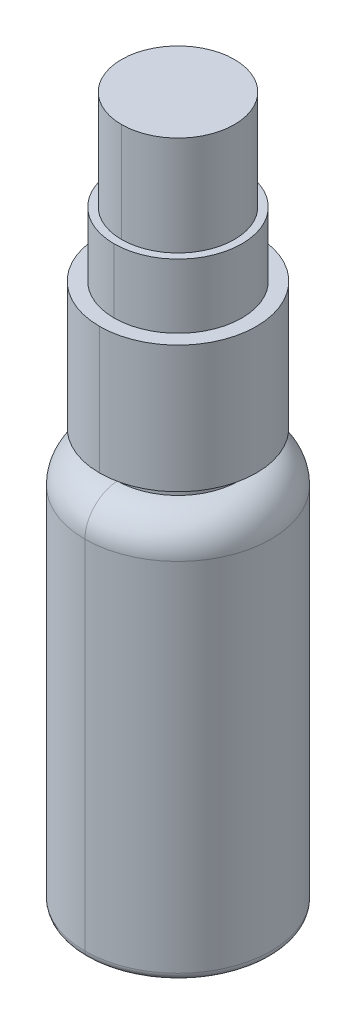
ISO-10303-21;
HEADER;
FILE_DESCRIPTION(('STEP AP214'),'2;1');
FILE_NAME('part.step','',(''),(''),'','','');
FILE_SCHEMA(('AUTOMOTIVE_DESIGN { 1 0 10303 214 1 1 1 1 }'));
ENDSEC;
DATA;
#1=APPLICATION_CONTEXT('core data for automotive mechanical design processes');
#2=APPLICATION_PROTOCOL_DEFINITION('international standard','automotive_design',2000,#1);
#3=PRODUCT_CONTEXT('',#1,'mechanical');
#4=PRODUCT('Part','Part','',(#3));
#5=PRODUCT_RELATED_PRODUCT_CATEGORY('part','',(#4));
#6=PRODUCT_DEFINITION_FORMATION('','',#4);
#7=PRODUCT_DEFINITION_CONTEXT('part definition',#1,'design');
#8=PRODUCT_DEFINITION('design','',#6,#7);
#9=PRODUCT_DEFINITION_SHAPE('','',#8);
#10=(LENGTH_UNIT() NAMED_UNIT(*) SI_UNIT(.MILLI.,.METRE.));
#11=(NAMED_UNIT(*) PLANE_ANGLE_UNIT() SI_UNIT($,.RADIAN.));
#12=(NAMED_UNIT(*) SI_UNIT($,.STERADIAN.) SOLID_ANGLE_UNIT());
#13=UNCERTAINTY_MEASURE_WITH_UNIT(LENGTH_MEASURE(1.E-05),#10,'distance_accuracy_value','');
#14=(GEOMETRIC_REPRESENTATION_CONTEXT(3) GLOBAL_UNCERTAINTY_ASSIGNED_CONTEXT((#13)) GLOBAL_UNIT_ASSIGNED_CONTEXT((#10,
#11,#12)) REPRESENTATION_CONTEXT('',''));
#15=CARTESIAN_POINT('',(0.,0.,0.));
#16=DIRECTION('',(0.,0.,1.));
#17=DIRECTION('',(1.,0.,0.));
#18=AXIS2_PLACEMENT_3D('',#15,#16,#17);
#19=CARTESIAN_POINT('',(0.,46.5,0.));
#20=DIRECTION('',(0.,1.,0.));
#21=DIRECTION('',(0.,0.,1.));
#22=AXIS2_PLACEMENT_3D('',#19,#20,#21);
#23=TOROIDAL_SURFACE('',#22,7.5,4.375);
#24=CARTESIAN_POINT('',(0.,46.5,-7.5));
#25=DIRECTION('',(1.,0.,0.));
#26=DIRECTION('',(0.,0.,-1.));
#27=AXIS2_PLACEMENT_3D('',#24,#25,#26);
#28=CIRCLE('',#27,4.375);
#29=CARTESIAN_POINT('',(0.,46.5,-11.875));
#30=VERTEX_POINT('',#29);
#31=CARTESIAN_POINT('',(0.,50.875,-7.5));
#32=VERTEX_POINT('',#31);
#33=EDGE_CURVE('E358',#30,#32,#28,.T.);
#34=ORIENTED_EDGE('',*,*,#33,.F.);
#35=CARTESIAN_POINT('',(0.,46.5,0.));
#36=DIRECTION('',(0.,1.,0.));
#37=DIRECTION('',(0.,0.,1.));
#38=AXIS2_PLACEMENT_3D('',#35,#36,#37);
#39=CIRCLE('',#38,11.875);
#40=CARTESIAN_POINT('',(0.,46.5,11.875));
#41=VERTEX_POINT('',#40);
#42=EDGE_CURVE('E11',#30,#41,#39,.T.);
#43=ORIENTED_EDGE('',*,*,#42,.T.);
#44=CARTESIAN_POINT('',(0.,46.5,7.5));
#45=DIRECTION('',(-1.,0.,0.));
#46=DIRECTION('',(0.,0.,1.));
#47=AXIS2_PLACEMENT_3D('',#44,#45,#46);
#48=CIRCLE('',#47,4.375);
#49=CARTESIAN_POINT('',(0.,50.875,7.5));
#50=VERTEX_POINT('',#49);
#51=EDGE_CURVE('E201',#41,#50,#48,.T.);
#52=ORIENTED_EDGE('',*,*,#51,.T.);
#53=CARTESIAN_POINT('',(0.,50.875,0.));
#54=DIRECTION('',(0.,1.,0.));
#55=DIRECTION('',(0.,0.,1.));
#56=AXIS2_PLACEMENT_3D('',#53,#54,#55);
#57=CIRCLE('',#56,7.5);
#58=EDGE_CURVE('E246',#32,#50,#57,.T.);
#59=ORIENTED_EDGE('',*,*,#58,.F.);
#60=EDGE_LOOP('',(#34,#43,#52,#59));
#61=FACE_BOUND('',#60,.T.);
#62=ADVANCED_FACE('F17',(#61),#23,.T.);
#63=CARTESIAN_POINT('',(0.,65.8,0.));
#64=DIRECTION('',(0.,1.,0.));
#65=DIRECTION('',(0.,0.,1.));
#66=AXIS2_PLACEMENT_3D('',#63,#64,#65);
#67=CYLINDRICAL_SURFACE('',#66,11.875);
#68=DIRECTION('',(0.,1.,0.));
#69=VECTOR('',#68,1.);
#70=CARTESIAN_POINT('',(0.,65.8,-11.875));
#71=LINE('',#70,#69);
#72=CARTESIAN_POINT('',(0.,1.,-11.875));
#73=VERTEX_POINT('',#72);
#74=EDGE_CURVE('E192',#73,#30,#71,.T.);
#75=ORIENTED_EDGE('',*,*,#74,.F.);
#76=CARTESIAN_POINT('',(0.,1.,0.));
#77=DIRECTION('',(0.,1.,0.));
#78=DIRECTION('',(0.,0.,1.));
#79=AXIS2_PLACEMENT_3D('',#76,#77,#78);
#80=CIRCLE('',#79,11.875);
#81=CARTESIAN_POINT('',(0.,1.,11.875));
#82=VERTEX_POINT('',#81);
#83=EDGE_CURVE('E26',#73,#82,#80,.T.);
#84=ORIENTED_EDGE('',*,*,#83,.T.);
#85=DIRECTION('',(0.,1.,0.));
#86=VECTOR('',#85,1.);
#87=CARTESIAN_POINT('',(0.,65.8,11.875));
#88=LINE('',#87,#86);
#89=EDGE_CURVE('E197',#82,#41,#88,.T.);
#90=ORIENTED_EDGE('',*,*,#89,.T.);
#91=ORIENTED_EDGE('',*,*,#42,.F.);
#92=EDGE_LOOP('',(#75,#84,#90,#91));
#93=FACE_BOUND('',#92,.T.);
#94=ADVANCED_FACE('F19',(#93),#67,.T.);
#95=CARTESIAN_POINT('',(0.,1.,0.));
#96=DIRECTION('',(0.,1.,0.));
#97=DIRECTION('',(0.,0.,1.));
#98=AXIS2_PLACEMENT_3D('',#95,#96,#97);
#99=TOROIDAL_SURFACE('',#98,10.875,1.);
#100=CARTESIAN_POINT('',(0.,1.,-10.875));
#101=DIRECTION('',(1.,0.,0.));
#102=DIRECTION('',(0.,0.,-1.));
#103=AXIS2_PLACEMENT_3D('',#100,#101,#102);
#104=CIRCLE('',#103,1.);
#105=CARTESIAN_POINT('',(0.,0.,-10.875));
#106=VERTEX_POINT('',#105);
#107=EDGE_CURVE('E171',#106,#73,#104,.T.);
#108=ORIENTED_EDGE('',*,*,#107,.F.);
#109=CARTESIAN_POINT('',(0.,0.,0.));
#110=DIRECTION('',(0.,1.,0.));
#111=DIRECTION('',(0.,0.,1.));
#112=AXIS2_PLACEMENT_3D('',#109,#110,#111);
#113=CIRCLE('',#112,10.875);
#114=CARTESIAN_POINT('',(0.,0.,10.875));
#115=VERTEX_POINT('',#114);
#116=EDGE_CURVE('E180',#106,#115,#113,.T.);
#117=ORIENTED_EDGE('',*,*,#116,.T.);
#118=CARTESIAN_POINT('',(0.,1.,10.875));
#119=DIRECTION('',(-1.,0.,0.));
#120=DIRECTION('',(0.,0.,1.));
#121=AXIS2_PLACEMENT_3D('',#118,#119,#120);
#122=CIRCLE('',#121,1.);
#123=EDGE_CURVE('E174',#115,#82,#122,.T.);
#124=ORIENTED_EDGE('',*,*,#123,.T.);
#125=ORIENTED_EDGE('',*,*,#83,.F.);
#126=EDGE_LOOP('',(#108,#117,#124,#125));
#127=FACE_BOUND('',#126,.T.);
#128=ADVANCED_FACE('F170',(#127),#99,.T.);
#129=CARTESIAN_POINT('',(9.75,0.,0.));
#130=DIRECTION('',(0.,1.,0.));
#131=DIRECTION('',(1.,0.,0.));
#132=AXIS2_PLACEMENT_3D('',#129,#130,#131);
#133=PLANE('',#132);
#134=CARTESIAN_POINT('',(0.,0.,0.));
#135=DIRECTION('',(0.,1.,0.));
#136=DIRECTION('',(0.,0.,1.));
#137=AXIS2_PLACEMENT_3D('',#134,#135,#136);
#138=CIRCLE('',#137,9.75);
#139=CARTESIAN_POINT('',(0.,0.,9.75));
#140=VERTEX_POINT('',#139);
#141=CARTESIAN_POINT('',(0.,0.,-9.75));
#142=VERTEX_POINT('',#141);
#143=EDGE_CURVE('E226',#140,#142,#138,.T.);
#144=ORIENTED_EDGE('',*,*,#143,.T.);
#145=CARTESIAN_POINT('',(0.,0.,0.));
#146=DIRECTION('',(0.,1.,0.));
#147=DIRECTION('',(0.,0.,1.));
#148=AXIS2_PLACEMENT_3D('',#145,#146,#147);
#149=CIRCLE('',#148,9.75);
#150=EDGE_CURVE('E346',#142,#140,#149,.T.);
#151=ORIENTED_EDGE('',*,*,#150,.T.);
#152=EDGE_LOOP('',(#144,#151));
#153=FACE_BOUND('',#152,.T.);
#154=CARTESIAN_POINT('',(0.,0.,0.));
#155=DIRECTION('',(0.,1.,0.));
#156=DIRECTION('',(0.,0.,1.));
#157=AXIS2_PLACEMENT_3D('',#154,#155,#156);
#158=CIRCLE('',#157,10.875);
#159=EDGE_CURVE('E188',#115,#106,#158,.T.);
#160=ORIENTED_EDGE('',*,*,#159,.F.);
#161=ORIENTED_EDGE('',*,*,#116,.F.);
#162=EDGE_LOOP('',(#160,#161));
#163=FACE_BOUND('',#162,.T.);
#164=ADVANCED_FACE('F393',(#153,#163),#133,.F.);
#165=CARTESIAN_POINT('',(0.,1.,0.));
#166=DIRECTION('',(0.,1.,0.));
#167=DIRECTION('',(0.,0.,1.));
#168=AXIS2_PLACEMENT_3D('',#165,#166,#167);
#169=TOROIDAL_SURFACE('',#168,9.75,1.);
#170=CARTESIAN_POINT('',(0.,1.,-9.75));
#171=DIRECTION('',(1.,0.,0.));
#172=DIRECTION('',(0.,0.,-1.));
#173=AXIS2_PLACEMENT_3D('',#170,#171,#172);
#174=CIRCLE('',#173,1.);
#175=CARTESIAN_POINT('',(0.,1.,-8.75));
#176=VERTEX_POINT('',#175);
#177=EDGE_CURVE('E230',#176,#142,#174,.T.);
#178=ORIENTED_EDGE('',*,*,#177,.F.);
#179=CARTESIAN_POINT('',(0.,1.,0.));
#180=DIRECTION('',(0.,1.,0.));
#181=DIRECTION('',(0.,0.,1.));
#182=AXIS2_PLACEMENT_3D('',#179,#180,#181);
#183=CIRCLE('',#182,8.75);
#184=CARTESIAN_POINT('',(0.,1.,8.75));
#185=VERTEX_POINT('',#184);
#186=EDGE_CURVE('E211',#176,#185,#183,.T.);
#187=ORIENTED_EDGE('',*,*,#186,.T.);
#188=CARTESIAN_POINT('',(0.,1.,9.75));
#189=DIRECTION('',(-1.,0.,0.));
#190=DIRECTION('',(0.,0.,1.));
#191=AXIS2_PLACEMENT_3D('',#188,#189,#190);
#192=CIRCLE('',#191,1.);
#193=EDGE_CURVE('E216',#185,#140,#192,.T.);
#194=ORIENTED_EDGE('',*,*,#193,.T.);
#195=ORIENTED_EDGE('',*,*,#150,.F.);
#196=EDGE_LOOP('',(#178,#187,#194,#195));
#197=FACE_BOUND('',#196,.T.);
#198=ADVANCED_FACE('F392',(#197),#169,.T.);
#199=CARTESIAN_POINT('',(0.,65.8,0.));
#200=DIRECTION('',(0.,1.,0.));
#201=DIRECTION('',(0.,0.,1.));
#202=AXIS2_PLACEMENT_3D('',#199,#200,#201);
#203=CYLINDRICAL_SURFACE('',#202,8.75);
#204=DIRECTION('',(0.,1.,0.));
#205=VECTOR('',#204,1.);
#206=CARTESIAN_POINT('',(0.,65.8,-8.75));
#207=LINE('',#206,#205);
#208=CARTESIAN_POINT('',(0.,1.40955855165527,-8.75));
#209=VERTEX_POINT('',#208);
#210=EDGE_CURVE('E215',#176,#209,#207,.T.);
#211=ORIENTED_EDGE('',*,*,#210,.F.);
#212=CARTESIAN_POINT('',(0.,1.,0.));
#213=DIRECTION('',(0.,1.,0.));
#214=DIRECTION('',(0.,0.,1.));
#215=AXIS2_PLACEMENT_3D('',#212,#213,#214);
#216=CIRCLE('',#215,8.75);
#217=EDGE_CURVE('E233',#185,#176,#216,.T.);
#218=ORIENTED_EDGE('',*,*,#217,.F.);
#219=DIRECTION('',(0.,1.,0.));
#220=VECTOR('',#219,1.);
#221=CARTESIAN_POINT('',(0.,65.8,8.75));
#222=LINE('',#221,#220);
#223=CARTESIAN_POINT('',(0.,1.40955855165527,8.75));
#224=VERTEX_POINT('',#223);
#225=EDGE_CURVE('E239',#185,#224,#222,.T.);
#226=ORIENTED_EDGE('',*,*,#225,.T.);
#227=CARTESIAN_POINT('',(0.,1.40955855165527,0.));
#228=DIRECTION('',(0.,1.,0.));
#229=DIRECTION('',(0.,0.,1.));
#230=AXIS2_PLACEMENT_3D('',#227,#228,#229);
#231=CIRCLE('',#230,8.75);
#232=EDGE_CURVE('E345',#224,#209,#231,.T.);
#233=ORIENTED_EDGE('',*,*,#232,.T.);
#234=EDGE_LOOP('',(#211,#218,#226,#233));
#235=FACE_BOUND('',#234,.T.);
#236=ADVANCED_FACE('F387',(#235),#203,.F.);
#237=CARTESIAN_POINT('',(0.,1.40955855165527,0.));
#238=DIRECTION('',(0.,1.,0.));
#239=DIRECTION('',(0.,0.,1.));
#240=AXIS2_PLACEMENT_3D('',#237,#238,#239);
#241=TOROIDAL_SURFACE('',#240,7.75,1.);
#242=CARTESIAN_POINT('',(0.,1.40955855165527,-7.75));
#243=DIRECTION('',(1.,0.,0.));
#244=DIRECTION('',(0.,0.,-1.));
#245=AXIS2_PLACEMENT_3D('',#242,#243,#244);
#246=CIRCLE('',#245,1.);
#247=CARTESIAN_POINT('',(0.,2.40955855165527,-7.75));
#248=VERTEX_POINT('',#247);
#249=EDGE_CURVE('E234',#209,#248,#246,.T.);
#250=ORIENTED_EDGE('',*,*,#249,.F.);
#251=ORIENTED_EDGE('',*,*,#232,.F.);
#252=CARTESIAN_POINT('',(0.,1.40955855165527,7.75));
#253=DIRECTION('',(-1.,0.,0.));
#254=DIRECTION('',(0.,0.,1.));
#255=AXIS2_PLACEMENT_3D('',#252,#253,#254);
#256=CIRCLE('',#255,1.);
#257=CARTESIAN_POINT('',(0.,2.40955855165527,7.75));
#258=VERTEX_POINT('',#257);
#259=EDGE_CURVE('E272',#224,#258,#256,.T.);
#260=ORIENTED_EDGE('',*,*,#259,.T.);
#261=CARTESIAN_POINT('',(0.,2.40955855165527,0.));
#262=DIRECTION('',(0.,1.,0.));
#263=DIRECTION('',(0.,0.,1.));
#264=AXIS2_PLACEMENT_3D('',#261,#262,#263);
#265=CIRCLE('',#264,7.75);
#266=EDGE_CURVE('E343',#258,#248,#265,.T.);
#267=ORIENTED_EDGE('',*,*,#266,.T.);
#268=EDGE_LOOP('',(#250,#251,#260,#267));
#269=FACE_BOUND('',#268,.T.);
#270=ADVANCED_FACE('F414',(#269),#241,.F.);
#271=CARTESIAN_POINT('',(7.75,2.40955855165527,0.));
#272=DIRECTION('',(0.,-1.,0.));
#273=DIRECTION('',(0.,0.,-1.));
#274=AXIS2_PLACEMENT_3D('',#271,#272,#273);
#275=PLANE('',#274);
#276=ORIENTED_EDGE('',*,*,#266,.F.);
#277=CARTESIAN_POINT('',(0.,2.40955855165527,0.));
#278=DIRECTION('',(0.,1.,0.));
#279=DIRECTION('',(0.,0.,1.));
#280=AXIS2_PLACEMENT_3D('',#277,#278,#279);
#281=CIRCLE('',#280,7.75);
#282=EDGE_CURVE('E238',#248,#258,#281,.T.);
#283=ORIENTED_EDGE('',*,*,#282,.F.);
#284=EDGE_LOOP('',(#276,#283));
#285=FACE_BOUND('',#284,.T.);
#286=ADVANCED_FACE('F415',(#285),#275,.T.);
#287=CARTESIAN_POINT('',(0.,89.975,0.));
#288=DIRECTION('',(0.,1.,0.));
#289=DIRECTION('',(1.,0.,0.));
#290=AXIS2_PLACEMENT_3D('',#287,#288,#289);
#291=PLANE('',#290);
#292=CARTESIAN_POINT('',(0.,89.975,0.));
#293=DIRECTION('',(0.,1.,0.));
#294=DIRECTION('',(0.,0.,1.));
#295=AXIS2_PLACEMENT_3D('',#292,#293,#294);
#296=CIRCLE('',#295,7.2);
#297=CARTESIAN_POINT('',(0.,89.975,7.2));
#298=VERTEX_POINT('',#297);
#299=CARTESIAN_POINT('',(0.,89.975,-7.2));
#300=VERTEX_POINT('',#299);
#301=EDGE_CURVE('E248',#298,#300,#296,.T.);
#302=ORIENTED_EDGE('',*,*,#301,.T.);
#303=CARTESIAN_POINT('',(0.,89.975,0.));
#304=DIRECTION('',(0.,1.,0.));
#305=DIRECTION('',(0.,0.,1.));
#306=AXIS2_PLACEMENT_3D('',#303,#304,#305);
#307=CIRCLE('',#306,7.2);
#308=EDGE_CURVE('E261',#300,#298,#307,.T.);
#309=ORIENTED_EDGE('',*,*,#308,.T.);
#310=EDGE_LOOP('',(#302,#309));
#311=FACE_BOUND('',#310,.T.);
#312=ADVANCED_FACE('F418',(#311),#291,.T.);
#313=CARTESIAN_POINT('',(0.,65.8,0.));
#314=DIRECTION('',(0.,1.,0.));
#315=DIRECTION('',(0.,0.,1.));
#316=AXIS2_PLACEMENT_3D('',#313,#314,#315);
#317=CYLINDRICAL_SURFACE('',#316,7.2);
#318=DIRECTION('',(0.,1.,0.));
#319=VECTOR('',#318,1.);
#320=CARTESIAN_POINT('',(0.,65.8,-7.2));
#321=LINE('',#320,#319);
#322=CARTESIAN_POINT('',(0.,77.275,-7.2));
#323=VERTEX_POINT('',#322);
#324=EDGE_CURVE('E253',#323,#300,#321,.T.);
#325=ORIENTED_EDGE('',*,*,#324,.F.);
#326=CARTESIAN_POINT('',(0.,77.275,0.));
#327=DIRECTION('',(0.,1.,0.));
#328=DIRECTION('',(0.,0.,1.));
#329=AXIS2_PLACEMENT_3D('',#326,#327,#328);
#330=CIRCLE('',#329,7.2);
#331=CARTESIAN_POINT('',(0.,77.275,7.2));
#332=VERTEX_POINT('',#331);
#333=EDGE_CURVE('E258',#323,#332,#330,.T.);
#334=ORIENTED_EDGE('',*,*,#333,.T.);
#335=DIRECTION('',(0.,1.,0.));
#336=VECTOR('',#335,1.);
#337=CARTESIAN_POINT('',(0.,65.8,7.2));
#338=LINE('',#337,#336);
#339=EDGE_CURVE('E252',#332,#298,#338,.T.);
#340=ORIENTED_EDGE('',*,*,#339,.T.);
#341=ORIENTED_EDGE('',*,*,#308,.F.);
#342=EDGE_LOOP('',(#325,#334,#340,#341));
#343=FACE_BOUND('',#342,.T.);
#344=ADVANCED_FACE('F422',(#343),#317,.T.);
#345=CARTESIAN_POINT('',(8.15,77.275,0.));
#346=DIRECTION('',(0.,-1.,0.));
#347=DIRECTION('',(0.,0.,-1.));
#348=AXIS2_PLACEMENT_3D('',#345,#346,#347);
#349=PLANE('',#348);
#350=CARTESIAN_POINT('',(0.,77.275,0.));
#351=DIRECTION('',(0.,1.,0.));
#352=DIRECTION('',(0.,0.,1.));
#353=AXIS2_PLACEMENT_3D('',#350,#351,#352);
#354=CIRCLE('',#353,7.2);
#355=EDGE_CURVE('E276',#332,#323,#354,.T.);
#356=ORIENTED_EDGE('',*,*,#355,.F.);
#357=ORIENTED_EDGE('',*,*,#333,.F.);
#358=EDGE_LOOP('',(#356,#357));
#359=FACE_BOUND('',#358,.T.);
#360=CARTESIAN_POINT('',(0.,77.275,0.));
#361=DIRECTION('',(0.,1.,0.));
#362=DIRECTION('',(0.,0.,1.));
#363=AXIS2_PLACEMENT_3D('',#360,#361,#362);
#364=CIRCLE('',#363,8.15);
#365=CARTESIAN_POINT('',(0.,77.275,8.15));
#366=VERTEX_POINT('',#365);
#367=CARTESIAN_POINT('',(0.,77.275,-8.15));
#368=VERTEX_POINT('',#367);
#369=EDGE_CURVE('E294',#366,#368,#364,.T.);
#370=ORIENTED_EDGE('',*,*,#369,.T.);
#371=CARTESIAN_POINT('',(0.,77.275,0.));
#372=DIRECTION('',(0.,1.,0.));
#373=DIRECTION('',(0.,0.,1.));
#374=AXIS2_PLACEMENT_3D('',#371,#372,#373);
#375=CIRCLE('',#374,8.15);
#376=EDGE_CURVE('E262',#368,#366,#375,.T.);
#377=ORIENTED_EDGE('',*,*,#376,.T.);
#378=EDGE_LOOP('',(#370,#377));
#379=FACE_BOUND('',#378,.T.);
#380=ADVANCED_FACE('F426',(#359,#379),#349,.F.);
#381=CARTESIAN_POINT('',(0.,65.8,0.));
#382=DIRECTION('',(0.,1.,0.));
#383=DIRECTION('',(0.,0.,1.));
#384=AXIS2_PLACEMENT_3D('',#381,#382,#383);
#385=CYLINDRICAL_SURFACE('',#384,8.15);
#386=DIRECTION('',(0.,1.,0.));
#387=VECTOR('',#386,1.);
#388=CARTESIAN_POINT('',(0.,65.8,-8.15));
#389=LINE('',#388,#387);
#390=CARTESIAN_POINT('',(0.,69.075,-8.15));
#391=VERTEX_POINT('',#390);
#392=EDGE_CURVE('E290',#391,#368,#389,.T.);
#393=ORIENTED_EDGE('',*,*,#392,.F.);
#394=CARTESIAN_POINT('',(0.,69.075,0.));
#395=DIRECTION('',(0.,1.,0.));
#396=DIRECTION('',(0.,0.,1.));
#397=AXIS2_PLACEMENT_3D('',#394,#395,#396);
#398=CIRCLE('',#397,8.15);
#399=CARTESIAN_POINT('',(0.,69.075,8.15));
#400=VERTEX_POINT('',#399);
#401=EDGE_CURVE('E220',#391,#400,#398,.T.);
#402=ORIENTED_EDGE('',*,*,#401,.T.);
#403=DIRECTION('',(0.,1.,0.));
#404=VECTOR('',#403,1.);
#405=CARTESIAN_POINT('',(0.,65.8,8.15));
#406=LINE('',#405,#404);
#407=EDGE_CURVE('E298',#400,#366,#406,.T.);
#408=ORIENTED_EDGE('',*,*,#407,.T.);
#409=ORIENTED_EDGE('',*,*,#376,.F.);
#410=EDGE_LOOP('',(#393,#402,#408,#409));
#411=FACE_BOUND('',#410,.T.);
#412=ADVANCED_FACE('F430',(#411),#385,.T.);
#413=CARTESIAN_POINT('',(10.,69.075,0.));
#414=DIRECTION('',(0.,-1.,0.));
#415=DIRECTION('',(0.,0.,-1.));
#416=AXIS2_PLACEMENT_3D('',#413,#414,#415);
#417=PLANE('',#416);
#418=CARTESIAN_POINT('',(0.,69.075,0.));
#419=DIRECTION('',(0.,1.,0.));
#420=DIRECTION('',(0.,0.,1.));
#421=AXIS2_PLACEMENT_3D('',#418,#419,#420);
#422=CIRCLE('',#421,8.15);
#423=EDGE_CURVE('E286',#400,#391,#422,.T.);
#424=ORIENTED_EDGE('',*,*,#423,.F.);
#425=ORIENTED_EDGE('',*,*,#401,.F.);
#426=EDGE_LOOP('',(#424,#425));
#427=FACE_BOUND('',#426,.T.);
#428=CARTESIAN_POINT('',(0.,69.075,0.));
#429=DIRECTION('',(0.,1.,0.));
#430=DIRECTION('',(0.,0.,1.));
#431=AXIS2_PLACEMENT_3D('',#428,#429,#430);
#432=CIRCLE('',#431,10.);
#433=CARTESIAN_POINT('',(0.,69.075,10.));
#434=VERTEX_POINT('',#433);
#435=CARTESIAN_POINT('',(0.,69.075,-10.));
#436=VERTEX_POINT('',#435);
#437=EDGE_CURVE('E310',#434,#436,#432,.T.);
#438=ORIENTED_EDGE('',*,*,#437,.T.);
#439=CARTESIAN_POINT('',(0.,69.075,0.));
#440=DIRECTION('',(0.,1.,0.));
#441=DIRECTION('',(0.,0.,1.));
#442=AXIS2_PLACEMENT_3D('',#439,#440,#441);
#443=CIRCLE('',#442,10.);
#444=EDGE_CURVE('E217',#436,#434,#443,.T.);
#445=ORIENTED_EDGE('',*,*,#444,.T.);
#446=EDGE_LOOP('',(#438,#445));
#447=FACE_BOUND('',#446,.T.);
#448=ADVANCED_FACE('F432',(#427,#447),#417,.F.);
#449=CARTESIAN_POINT('',(0.,65.8,0.));
#450=DIRECTION('',(0.,1.,0.));
#451=DIRECTION('',(0.,0.,1.));
#452=AXIS2_PLACEMENT_3D('',#449,#450,#451);
#453=CYLINDRICAL_SURFACE('',#452,10.);
#454=DIRECTION('',(0.,1.,0.));
#455=VECTOR('',#454,1.);
#456=CARTESIAN_POINT('',(0.,65.8,-10.));
#457=LINE('',#456,#455);
#458=CARTESIAN_POINT('',(0.,52.875,-10.));
#459=VERTEX_POINT('',#458);
#460=EDGE_CURVE('E306',#459,#436,#457,.T.);
#461=ORIENTED_EDGE('',*,*,#460,.F.);
#462=CARTESIAN_POINT('',(0.,52.875,0.));
#463=DIRECTION('',(0.,1.,0.));
#464=DIRECTION('',(0.,0.,1.));
#465=AXIS2_PLACEMENT_3D('',#462,#463,#464);
#466=CIRCLE('',#465,10.);
#467=CARTESIAN_POINT('',(0.,52.875,10.));
#468=VERTEX_POINT('',#467);
#469=EDGE_CURVE('E221',#459,#468,#466,.T.);
#470=ORIENTED_EDGE('',*,*,#469,.T.);
#471=DIRECTION('',(0.,1.,0.));
#472=VECTOR('',#471,1.);
#473=CARTESIAN_POINT('',(0.,65.8,10.));
#474=LINE('',#473,#472);
#475=EDGE_CURVE('E314',#468,#434,#474,.T.);
#476=ORIENTED_EDGE('',*,*,#475,.T.);
#477=ORIENTED_EDGE('',*,*,#444,.F.);
#478=EDGE_LOOP('',(#461,#470,#476,#477));
#479=FACE_BOUND('',#478,.T.);
#480=ADVANCED_FACE('F435',(#479),#453,.T.);
#481=CARTESIAN_POINT('',(7.75,52.875,0.));
#482=DIRECTION('',(0.,1.,0.));
#483=DIRECTION('',(1.,0.,0.));
#484=AXIS2_PLACEMENT_3D('',#481,#482,#483);
#485=PLANE('',#484);
#486=CARTESIAN_POINT('',(0.,52.875,0.));
#487=DIRECTION('',(0.,1.,0.));
#488=DIRECTION('',(0.,0.,1.));
#489=AXIS2_PLACEMENT_3D('',#486,#487,#488);
#490=CIRCLE('',#489,7.75);
#491=CARTESIAN_POINT('',(0.,52.875,7.75));
#492=VERTEX_POINT('',#491);
#493=CARTESIAN_POINT('',(0.,52.875,-7.75));
#494=VERTEX_POINT('',#493);
#495=EDGE_CURVE('E326',#492,#494,#490,.T.);
#496=ORIENTED_EDGE('',*,*,#495,.T.);
#497=CARTESIAN_POINT('',(0.,52.875,0.));
#498=DIRECTION('',(0.,1.,0.));
#499=DIRECTION('',(0.,0.,1.));
#500=AXIS2_PLACEMENT_3D('',#497,#498,#499);
#501=CIRCLE('',#500,7.75);
#502=EDGE_CURVE('E38',#494,#492,#501,.T.);
#503=ORIENTED_EDGE('',*,*,#502,.T.);
#504=EDGE_LOOP('',(#496,#503));
#505=FACE_BOUND('',#504,.T.);
#506=CARTESIAN_POINT('',(0.,52.875,0.));
#507=DIRECTION('',(0.,1.,0.));
#508=DIRECTION('',(0.,0.,1.));
#509=AXIS2_PLACEMENT_3D('',#506,#507,#508);
#510=CIRCLE('',#509,10.);
#511=EDGE_CURVE('E302',#468,#459,#510,.T.);
#512=ORIENTED_EDGE('',*,*,#511,.F.);
#513=ORIENTED_EDGE('',*,*,#469,.F.);
#514=EDGE_LOOP('',(#512,#513));
#515=FACE_BOUND('',#514,.T.);
#516=ADVANCED_FACE('F437',(#505,#515),#485,.F.);
#517=CARTESIAN_POINT('',(0.,65.8,0.));
#518=DIRECTION('',(0.,1.,0.));
#519=DIRECTION('',(0.,0.,1.));
#520=AXIS2_PLACEMENT_3D('',#517,#518,#519);
#521=CYLINDRICAL_SURFACE('',#520,7.75);
#522=DIRECTION('',(0.,1.,0.));
#523=VECTOR('',#522,1.);
#524=CARTESIAN_POINT('',(0.,65.8,-7.75));
#525=LINE('',#524,#523);
#526=CARTESIAN_POINT('',(0.,50.875,-7.75));
#527=VERTEX_POINT('',#526);
#528=EDGE_CURVE('E322',#527,#494,#525,.T.);
#529=ORIENTED_EDGE('',*,*,#528,.F.);
#530=CARTESIAN_POINT('',(0.,50.875,0.));
#531=DIRECTION('',(0.,1.,0.));
#532=DIRECTION('',(0.,0.,1.));
#533=AXIS2_PLACEMENT_3D('',#530,#531,#532);
#534=CIRCLE('',#533,7.75);
#535=CARTESIAN_POINT('',(0.,50.875,7.75));
#536=VERTEX_POINT('',#535);
#537=EDGE_CURVE('E243',#527,#536,#534,.T.);
#538=ORIENTED_EDGE('',*,*,#537,.T.);
#539=DIRECTION('',(0.,1.,0.));
#540=VECTOR('',#539,1.);
#541=CARTESIAN_POINT('',(0.,65.8,7.75));
#542=LINE('',#541,#540);
#543=EDGE_CURVE('E247',#536,#492,#542,.T.);
#544=ORIENTED_EDGE('',*,*,#543,.T.);
#545=ORIENTED_EDGE('',*,*,#502,.F.);
#546=EDGE_LOOP('',(#529,#538,#544,#545));
#547=FACE_BOUND('',#546,.T.);
#548=ADVANCED_FACE('F440',(#547),#521,.T.);
#549=CARTESIAN_POINT('',(7.5,50.875,0.));
#550=DIRECTION('',(0.,1.,0.));
#551=DIRECTION('',(1.,0.,0.));
#552=AXIS2_PLACEMENT_3D('',#549,#550,#551);
#553=PLANE('',#552);
#554=CARTESIAN_POINT('',(0.,50.875,0.));
#555=DIRECTION('',(0.,1.,0.));
#556=DIRECTION('',(0.,0.,1.));
#557=AXIS2_PLACEMENT_3D('',#554,#555,#556);
#558=CIRCLE('',#557,7.5);
#559=EDGE_CURVE('E207',#50,#32,#558,.T.);
#560=ORIENTED_EDGE('',*,*,#559,.T.);
#561=ORIENTED_EDGE('',*,*,#58,.T.);
#562=EDGE_LOOP('',(#560,#561));
#563=FACE_BOUND('',#562,.T.);
#564=CARTESIAN_POINT('',(0.,50.875,0.));
#565=DIRECTION('',(0.,1.,0.));
#566=DIRECTION('',(0.,0.,1.));
#567=AXIS2_PLACEMENT_3D('',#564,#565,#566);
#568=CIRCLE('',#567,7.75);
#569=EDGE_CURVE('E318',#536,#527,#568,.T.);
#570=ORIENTED_EDGE('',*,*,#569,.F.);
#571=ORIENTED_EDGE('',*,*,#537,.F.);
#572=EDGE_LOOP('',(#570,#571));
#573=FACE_BOUND('',#572,.T.);
#574=ADVANCED_FACE('F446',(#563,#573),#553,.F.);
#575=CARTESIAN_POINT('',(0.,65.8,0.));
#576=DIRECTION('',(0.,1.,0.));
#577=DIRECTION('',(0.,0.,1.));
#578=AXIS2_PLACEMENT_3D('',#575,#576,#577);
#579=CYLINDRICAL_SURFACE('',#578,7.75);
#580=ORIENTED_EDGE('',*,*,#569,.T.);
#581=ORIENTED_EDGE('',*,*,#528,.T.);
#582=ORIENTED_EDGE('',*,*,#495,.F.);
#583=ORIENTED_EDGE('',*,*,#543,.F.);
#584=EDGE_LOOP('',(#580,#581,#582,#583));
#585=FACE_BOUND('',#584,.T.);
#586=ADVANCED_FACE('F448',(#585),#579,.T.);
#587=CARTESIAN_POINT('',(0.,65.8,0.));
#588=DIRECTION('',(0.,1.,0.));
#589=DIRECTION('',(0.,0.,1.));
#590=AXIS2_PLACEMENT_3D('',#587,#588,#589);
#591=CYLINDRICAL_SURFACE('',#590,10.);
#592=ORIENTED_EDGE('',*,*,#511,.T.);
#593=ORIENTED_EDGE('',*,*,#460,.T.);
#594=ORIENTED_EDGE('',*,*,#437,.F.);
#595=ORIENTED_EDGE('',*,*,#475,.F.);
#596=EDGE_LOOP('',(#592,#593,#594,#595));
#597=FACE_BOUND('',#596,.T.);
#598=ADVANCED_FACE('F453',(#597),#591,.T.);
#599=CARTESIAN_POINT('',(0.,65.8,0.));
#600=DIRECTION('',(0.,1.,0.));
#601=DIRECTION('',(0.,0.,1.));
#602=AXIS2_PLACEMENT_3D('',#599,#600,#601);
#603=CYLINDRICAL_SURFACE('',#602,8.15);
#604=ORIENTED_EDGE('',*,*,#423,.T.);
#605=ORIENTED_EDGE('',*,*,#392,.T.);
#606=ORIENTED_EDGE('',*,*,#369,.F.);
#607=ORIENTED_EDGE('',*,*,#407,.F.);
#608=EDGE_LOOP('',(#604,#605,#606,#607));
#609=FACE_BOUND('',#608,.T.);
#610=ADVANCED_FACE('F469',(#609),#603,.T.);
#611=CARTESIAN_POINT('',(0.,65.8,0.));
#612=DIRECTION('',(0.,1.,0.));
#613=DIRECTION('',(0.,0.,1.));
#614=AXIS2_PLACEMENT_3D('',#611,#612,#613);
#615=CYLINDRICAL_SURFACE('',#614,7.2);
#616=ORIENTED_EDGE('',*,*,#355,.T.);
#617=ORIENTED_EDGE('',*,*,#324,.T.);
#618=ORIENTED_EDGE('',*,*,#301,.F.);
#619=ORIENTED_EDGE('',*,*,#339,.F.);
#620=EDGE_LOOP('',(#616,#617,#618,#619));
#621=FACE_BOUND('',#620,.T.);
#622=ADVANCED_FACE('F474',(#621),#615,.T.);
#623=CARTESIAN_POINT('',(0.,1.40955855165527,0.));
#624=DIRECTION('',(0.,1.,0.));
#625=DIRECTION('',(0.,0.,1.));
#626=AXIS2_PLACEMENT_3D('',#623,#624,#625);
#627=TOROIDAL_SURFACE('',#626,7.75,1.);
#628=CARTESIAN_POINT('',(0.,1.40955855165527,0.));
#629=DIRECTION('',(0.,1.,0.));
#630=DIRECTION('',(0.,0.,1.));
#631=AXIS2_PLACEMENT_3D('',#628,#629,#630);
#632=CIRCLE('',#631,8.75);
#633=EDGE_CURVE('E257',#209,#224,#632,.T.);
#634=ORIENTED_EDGE('',*,*,#633,.F.);
#635=ORIENTED_EDGE('',*,*,#249,.T.);
#636=ORIENTED_EDGE('',*,*,#282,.T.);
#637=ORIENTED_EDGE('',*,*,#259,.F.);
#638=EDGE_LOOP('',(#634,#635,#636,#637));
#639=FACE_BOUND('',#638,.T.);
#640=ADVANCED_FACE('F485',(#639),#627,.F.);
#641=CARTESIAN_POINT('',(0.,65.8,0.));
#642=DIRECTION('',(0.,1.,0.));
#643=DIRECTION('',(0.,0.,1.));
#644=AXIS2_PLACEMENT_3D('',#641,#642,#643);
#645=CYLINDRICAL_SURFACE('',#644,8.75);
#646=ORIENTED_EDGE('',*,*,#186,.F.);
#647=ORIENTED_EDGE('',*,*,#210,.T.);
#648=ORIENTED_EDGE('',*,*,#633,.T.);
#649=ORIENTED_EDGE('',*,*,#225,.F.);
#650=EDGE_LOOP('',(#646,#647,#648,#649));
#651=FACE_BOUND('',#650,.T.);
#652=ADVANCED_FACE('F390',(#651),#645,.F.);
#653=CARTESIAN_POINT('',(0.,1.,0.));
#654=DIRECTION('',(0.,1.,0.));
#655=DIRECTION('',(0.,0.,1.));
#656=AXIS2_PLACEMENT_3D('',#653,#654,#655);
#657=TOROIDAL_SURFACE('',#656,9.75,1.);
#658=ORIENTED_EDGE('',*,*,#217,.T.);
#659=ORIENTED_EDGE('',*,*,#177,.T.);
#660=ORIENTED_EDGE('',*,*,#143,.F.);
#661=ORIENTED_EDGE('',*,*,#193,.F.);
#662=EDGE_LOOP('',(#658,#659,#660,#661));
#663=FACE_BOUND('',#662,.T.);
#664=ADVANCED_FACE('F384',(#663),#657,.T.);
#665=CARTESIAN_POINT('',(0.,1.,0.));
#666=DIRECTION('',(0.,1.,0.));
#667=DIRECTION('',(0.,0.,1.));
#668=AXIS2_PLACEMENT_3D('',#665,#666,#667);
#669=TOROIDAL_SURFACE('',#668,10.875,1.);
#670=ORIENTED_EDGE('',*,*,#159,.T.);
#671=ORIENTED_EDGE('',*,*,#107,.T.);
#672=CARTESIAN_POINT('',(0.,1.,0.));
#673=DIRECTION('',(0.,1.,0.));
#674=DIRECTION('',(0.,0.,1.));
#675=AXIS2_PLACEMENT_3D('',#672,#673,#674);
#676=CIRCLE('',#675,11.875);
#677=EDGE_CURVE('E186',#82,#73,#676,.T.);
#678=ORIENTED_EDGE('',*,*,#677,.F.);
#679=ORIENTED_EDGE('',*,*,#123,.F.);
#680=EDGE_LOOP('',(#670,#671,#678,#679));
#681=FACE_BOUND('',#680,.T.);
#682=ADVANCED_FACE('F184',(#681),#669,.T.);
#683=CARTESIAN_POINT('',(0.,65.8,0.));
#684=DIRECTION('',(0.,1.,0.));
#685=DIRECTION('',(0.,0.,1.));
#686=AXIS2_PLACEMENT_3D('',#683,#684,#685);
#687=CYLINDRICAL_SURFACE('',#686,11.875);
#688=ORIENTED_EDGE('',*,*,#677,.T.);
#689=ORIENTED_EDGE('',*,*,#74,.T.);
#690=CARTESIAN_POINT('',(0.,46.5,0.));
#691=DIRECTION('',(0.,1.,0.));
#692=DIRECTION('',(0.,0.,1.));
#693=AXIS2_PLACEMENT_3D('',#690,#691,#692);
#694=CIRCLE('',#693,11.875);
#695=EDGE_CURVE('E367',#41,#30,#694,.T.);
#696=ORIENTED_EDGE('',*,*,#695,.F.);
#697=ORIENTED_EDGE('',*,*,#89,.F.);
#698=EDGE_LOOP('',(#688,#689,#696,#697));
#699=FACE_BOUND('',#698,.T.);
#700=ADVANCED_FACE('F199',(#699),#687,.T.);
#701=CARTESIAN_POINT('',(0.,46.5,0.));
#702=DIRECTION('',(0.,1.,0.));
#703=DIRECTION('',(0.,0.,1.));
#704=AXIS2_PLACEMENT_3D('',#701,#702,#703);
#705=TOROIDAL_SURFACE('',#704,7.5,4.375);
#706=ORIENTED_EDGE('',*,*,#695,.T.);
#707=ORIENTED_EDGE('',*,*,#33,.T.);
#708=ORIENTED_EDGE('',*,*,#559,.F.);
#709=ORIENTED_EDGE('',*,*,#51,.F.);
#710=EDGE_LOOP('',(#706,#707,#708,#709));
#711=FACE_BOUND('',#710,.T.);
#712=ADVANCED_FACE('F478',(#711),#705,.T.);
#713=CLOSED_SHELL('',(#62,#94,#128,#164,#198,#236,#270,#286,#312,#344,#380,#412,#448,#480,#516,
#548,#574,#586,#598,#610,#622,#640,#652,#664,#682,#700,#712));
#714=MANIFOLD_SOLID_BREP('B1',#713);
#715=ADVANCED_BREP_SHAPE_REPRESENTATION('',(#18,#714),#14);
#716=SHAPE_DEFINITION_REPRESENTATION(#9,#715);
ENDSEC;
END-ISO-10303-21;
